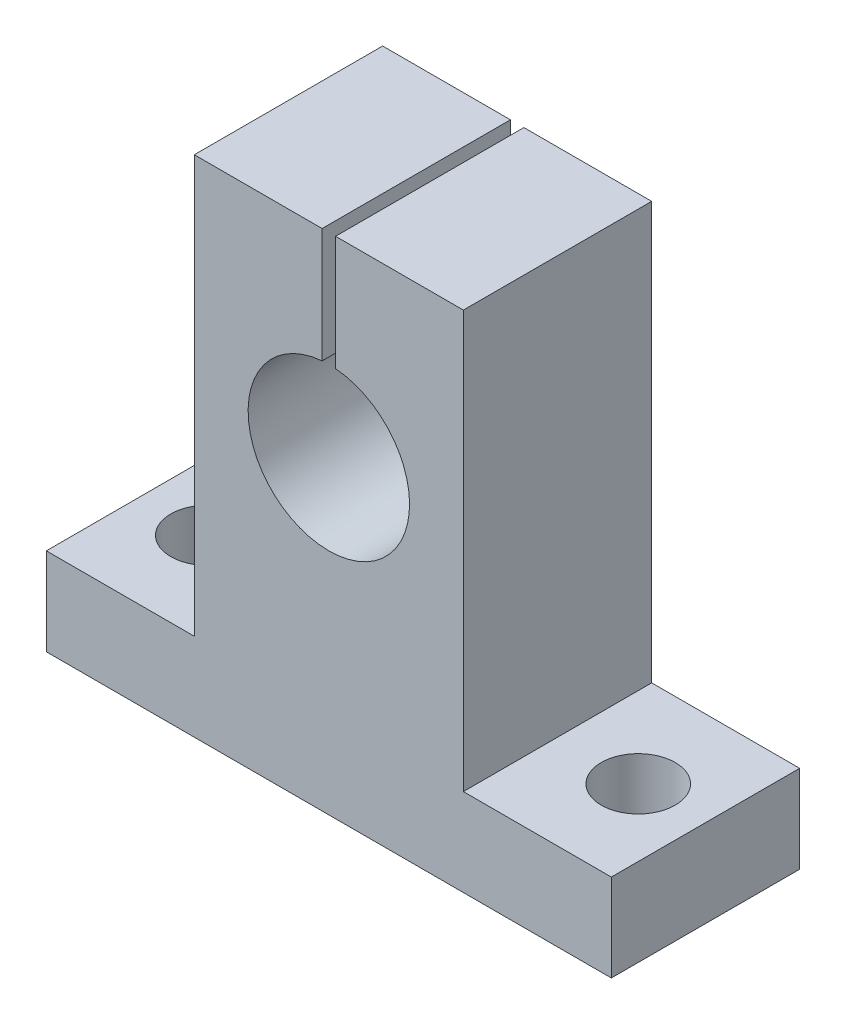
ISO-10303-21;
HEADER;
FILE_DESCRIPTION(('STEP AP214'),'2;1');
FILE_NAME('part.step','',(''),(''),'','','');
FILE_SCHEMA(('AUTOMOTIVE_DESIGN { 1 0 10303 214 1 1 1 1 }'));
ENDSEC;
DATA;
#1=APPLICATION_CONTEXT('core data for automotive mechanical design processes');
#2=APPLICATION_PROTOCOL_DEFINITION('international standard','automotive_design',2000,#1);
#3=PRODUCT_CONTEXT('',#1,'mechanical');
#4=PRODUCT('Part','Part','',(#3));
#5=PRODUCT_RELATED_PRODUCT_CATEGORY('part','',(#4));
#6=PRODUCT_DEFINITION_FORMATION('','',#4);
#7=PRODUCT_DEFINITION_CONTEXT('part definition',#1,'design');
#8=PRODUCT_DEFINITION('design','',#6,#7);
#9=PRODUCT_DEFINITION_SHAPE('','',#8);
#10=(LENGTH_UNIT() NAMED_UNIT(*) SI_UNIT(.MILLI.,.METRE.));
#11=(NAMED_UNIT(*) PLANE_ANGLE_UNIT() SI_UNIT($,.RADIAN.));
#12=(NAMED_UNIT(*) SI_UNIT($,.STERADIAN.) SOLID_ANGLE_UNIT());
#13=UNCERTAINTY_MEASURE_WITH_UNIT(LENGTH_MEASURE(1.E-05),#10,'distance_accuracy_value','');
#14=(GEOMETRIC_REPRESENTATION_CONTEXT(3) GLOBAL_UNCERTAINTY_ASSIGNED_CONTEXT((#13)) GLOBAL_UNIT_ASSIGNED_CONTEXT((#10,
#11,#12)) REPRESENTATION_CONTEXT('',''));
#15=CARTESIAN_POINT('',(0.,0.,0.));
#16=DIRECTION('',(0.,0.,1.));
#17=DIRECTION('',(1.,0.,0.));
#18=AXIS2_PLACEMENT_3D('',#15,#16,#17);
#19=CARTESIAN_POINT('',(-21.,-16.5,14.));
#20=DIRECTION('',(0.,1.,0.));
#21=DIRECTION('',(0.,0.,1.));
#22=AXIS2_PLACEMENT_3D('',#19,#20,#21);
#23=PLANE('',#22);
#24=CARTESIAN_POINT('',(-16.,-16.5,7.));
#25=DIRECTION('',(0.,1.,0.));
#26=DIRECTION('',(0.,0.,1.));
#27=AXIS2_PLACEMENT_3D('',#24,#25,#26);
#28=CIRCLE('',#27,2.75);
#29=CARTESIAN_POINT('',(-16.,-16.5,9.75));
#30=VERTEX_POINT('',#29);
#31=EDGE_CURVE('E271',#30,#30,#28,.F.);
#32=ORIENTED_EDGE('',*,*,#31,.T.);
#33=EDGE_LOOP('',(#32));
#34=FACE_BOUND('',#33,.T.);
#35=DIRECTION('',(1.,0.,0.));
#36=VECTOR('',#35,1.);
#37=CARTESIAN_POINT('',(-21.,-16.5,0.));
#38=LINE('',#37,#36);
#39=CARTESIAN_POINT('',(-21.,-16.5,0.));
#40=VERTEX_POINT('',#39);
#41=CARTESIAN_POINT('',(-9.99999999999999,-16.5,0.));
#42=VERTEX_POINT('',#41);
#43=EDGE_CURVE('E154',#40,#42,#38,.T.);
#44=ORIENTED_EDGE('',*,*,#43,.F.);
#45=DIRECTION('',(0.,0.,-1.));
#46=VECTOR('',#45,1.);
#47=CARTESIAN_POINT('',(-21.,-16.5,14.));
#48=LINE('',#47,#46);
#49=CARTESIAN_POINT('',(-21.,-16.5,14.));
#50=VERTEX_POINT('',#49);
#51=EDGE_CURVE('E11',#50,#40,#48,.T.);
#52=ORIENTED_EDGE('',*,*,#51,.F.);
#53=DIRECTION('',(1.,0.,0.));
#54=VECTOR('',#53,1.);
#55=CARTESIAN_POINT('',(-21.,-16.5,14.));
#56=LINE('',#55,#54);
#57=CARTESIAN_POINT('',(-9.99999999999999,-16.5,14.));
#58=VERTEX_POINT('',#57);
#59=EDGE_CURVE('E183',#50,#58,#56,.T.);
#60=ORIENTED_EDGE('',*,*,#59,.T.);
#61=DIRECTION('',(0.,0.,-1.));
#62=VECTOR('',#61,1.);
#63=CARTESIAN_POINT('',(-9.99999999999999,-16.5,14.));
#64=LINE('',#63,#62);
#65=EDGE_CURVE('E103',#58,#42,#64,.T.);
#66=ORIENTED_EDGE('',*,*,#65,.T.);
#67=EDGE_LOOP('',(#44,#52,#60,#66));
#68=FACE_BOUND('',#67,.T.);
#69=ADVANCED_FACE('F35',(#34,#68),#23,.T.);
#70=CARTESIAN_POINT('',(-21.,-23.,14.));
#71=DIRECTION('',(-1.,0.,0.));
#72=DIRECTION('',(0.,0.,1.));
#73=AXIS2_PLACEMENT_3D('',#70,#71,#72);
#74=PLANE('',#73);
#75=DIRECTION('',(0.,1.,0.));
#76=VECTOR('',#75,1.);
#77=CARTESIAN_POINT('',(-21.,-23.,0.));
#78=LINE('',#77,#76);
#79=CARTESIAN_POINT('',(-21.,-23.,0.));
#80=VERTEX_POINT('',#79);
#81=EDGE_CURVE('E181',#80,#40,#78,.T.);
#82=ORIENTED_EDGE('',*,*,#81,.F.);
#83=DIRECTION('',(0.,0.,-1.));
#84=VECTOR('',#83,1.);
#85=CARTESIAN_POINT('',(-21.,-23.,14.));
#86=LINE('',#85,#84);
#87=CARTESIAN_POINT('',(-21.,-23.,14.));
#88=VERTEX_POINT('',#87);
#89=EDGE_CURVE('E44',#88,#80,#86,.T.);
#90=ORIENTED_EDGE('',*,*,#89,.F.);
#91=DIRECTION('',(0.,1.,0.));
#92=VECTOR('',#91,1.);
#93=CARTESIAN_POINT('',(-21.,-23.,14.));
#94=LINE('',#93,#92);
#95=EDGE_CURVE('E149',#88,#50,#94,.T.);
#96=ORIENTED_EDGE('',*,*,#95,.T.);
#97=ORIENTED_EDGE('',*,*,#51,.T.);
#98=EDGE_LOOP('',(#82,#90,#96,#97));
#99=FACE_BOUND('',#98,.T.);
#100=ADVANCED_FACE('F207',(#99),#74,.T.);
#101=CARTESIAN_POINT('',(21.,-23.,14.));
#102=DIRECTION('',(0.,-1.,0.));
#103=DIRECTION('',(0.,0.,-1.));
#104=AXIS2_PLACEMENT_3D('',#101,#102,#103);
#105=PLANE('',#104);
#106=CARTESIAN_POINT('',(-16.,-23.,7.));
#107=DIRECTION('',(0.,-1.,0.));
#108=DIRECTION('',(0.,0.,-1.));
#109=AXIS2_PLACEMENT_3D('',#106,#107,#108);
#110=CIRCLE('',#109,2.75);
#111=CARTESIAN_POINT('',(-16.,-23.,4.25));
#112=VERTEX_POINT('',#111);
#113=EDGE_CURVE('E38',#112,#112,#110,.F.);
#114=ORIENTED_EDGE('',*,*,#113,.T.);
#115=EDGE_LOOP('',(#114));
#116=FACE_BOUND('',#115,.T.);
#117=CARTESIAN_POINT('',(16.,-23.,7.));
#118=DIRECTION('',(0.,-1.,0.));
#119=DIRECTION('',(0.,0.,-1.));
#120=AXIS2_PLACEMENT_3D('',#117,#118,#119);
#121=CIRCLE('',#120,2.75);
#122=CARTESIAN_POINT('',(16.,-23.,4.25));
#123=VERTEX_POINT('',#122);
#124=EDGE_CURVE('E272',#123,#123,#121,.F.);
#125=ORIENTED_EDGE('',*,*,#124,.T.);
#126=EDGE_LOOP('',(#125));
#127=FACE_BOUND('',#126,.T.);
#128=DIRECTION('',(-1.,0.,0.));
#129=VECTOR('',#128,1.);
#130=CARTESIAN_POINT('',(21.,-23.,0.));
#131=LINE('',#130,#129);
#132=CARTESIAN_POINT('',(21.,-23.,0.));
#133=VERTEX_POINT('',#132);
#134=EDGE_CURVE('E135',#133,#80,#131,.T.);
#135=ORIENTED_EDGE('',*,*,#134,.F.);
#136=DIRECTION('',(0.,0.,-1.));
#137=VECTOR('',#136,1.);
#138=CARTESIAN_POINT('',(21.,-23.,14.));
#139=LINE('',#138,#137);
#140=CARTESIAN_POINT('',(21.,-23.,14.));
#141=VERTEX_POINT('',#140);
#142=EDGE_CURVE('E129',#141,#133,#139,.T.);
#143=ORIENTED_EDGE('',*,*,#142,.F.);
#144=DIRECTION('',(-1.,0.,0.));
#145=VECTOR('',#144,1.);
#146=CARTESIAN_POINT('',(21.,-23.,14.));
#147=LINE('',#146,#145);
#148=EDGE_CURVE('E133',#141,#88,#147,.T.);
#149=ORIENTED_EDGE('',*,*,#148,.T.);
#150=ORIENTED_EDGE('',*,*,#89,.T.);
#151=EDGE_LOOP('',(#135,#143,#149,#150));
#152=FACE_BOUND('',#151,.T.);
#153=ADVANCED_FACE('F131',(#116,#127,#152),#105,.T.);
#154=CARTESIAN_POINT('',(21.,-23.,14.));
#155=DIRECTION('',(-1.,0.,0.));
#156=DIRECTION('',(0.,0.,1.));
#157=AXIS2_PLACEMENT_3D('',#154,#155,#156);
#158=PLANE('',#157);
#159=DIRECTION('',(0.,1.,0.));
#160=VECTOR('',#159,1.);
#161=CARTESIAN_POINT('',(21.,-23.,0.));
#162=LINE('',#161,#160);
#163=CARTESIAN_POINT('',(21.,-16.5,0.));
#164=VERTEX_POINT('',#163);
#165=EDGE_CURVE('E178',#133,#164,#162,.T.);
#166=ORIENTED_EDGE('',*,*,#165,.T.);
#167=DIRECTION('',(0.,0.,-1.));
#168=VECTOR('',#167,1.);
#169=CARTESIAN_POINT('',(21.,-16.5,14.));
#170=LINE('',#169,#168);
#171=CARTESIAN_POINT('',(21.,-16.5,14.));
#172=VERTEX_POINT('',#171);
#173=EDGE_CURVE('E138',#172,#164,#170,.T.);
#174=ORIENTED_EDGE('',*,*,#173,.F.);
#175=DIRECTION('',(0.,1.,0.));
#176=VECTOR('',#175,1.);
#177=CARTESIAN_POINT('',(21.,-23.,14.));
#178=LINE('',#177,#176);
#179=EDGE_CURVE('E141',#141,#172,#178,.T.);
#180=ORIENTED_EDGE('',*,*,#179,.F.);
#181=ORIENTED_EDGE('',*,*,#142,.T.);
#182=EDGE_LOOP('',(#166,#174,#180,#181));
#183=FACE_BOUND('',#182,.T.);
#184=ADVANCED_FACE('F142',(#183),#158,.F.);
#185=CARTESIAN_POINT('',(21.,-16.5,14.));
#186=DIRECTION('',(0.,-1.,0.));
#187=DIRECTION('',(0.,0.,-1.));
#188=AXIS2_PLACEMENT_3D('',#185,#186,#187);
#189=PLANE('',#188);
#190=CARTESIAN_POINT('',(16.,-16.5,7.));
#191=DIRECTION('',(0.,-1.,0.));
#192=DIRECTION('',(0.,0.,-1.));
#193=AXIS2_PLACEMENT_3D('',#190,#191,#192);
#194=CIRCLE('',#193,2.75);
#195=CARTESIAN_POINT('',(16.,-16.5,4.25));
#196=VERTEX_POINT('',#195);
#197=EDGE_CURVE('E273',#196,#196,#194,.F.);
#198=ORIENTED_EDGE('',*,*,#197,.F.);
#199=EDGE_LOOP('',(#198));
#200=FACE_BOUND('',#199,.T.);
#201=DIRECTION('',(-1.,0.,0.));
#202=VECTOR('',#201,1.);
#203=CARTESIAN_POINT('',(21.,-16.5,0.));
#204=LINE('',#203,#202);
#205=CARTESIAN_POINT('',(10.,-16.5,0.));
#206=VERTEX_POINT('',#205);
#207=EDGE_CURVE('E176',#164,#206,#204,.T.);
#208=ORIENTED_EDGE('',*,*,#207,.T.);
#209=DIRECTION('',(0.,0.,-1.));
#210=VECTOR('',#209,1.);
#211=CARTESIAN_POINT('',(10.,-16.5,14.));
#212=LINE('',#211,#210);
#213=CARTESIAN_POINT('',(10.,-16.5,14.));
#214=VERTEX_POINT('',#213);
#215=EDGE_CURVE('E187',#214,#206,#212,.T.);
#216=ORIENTED_EDGE('',*,*,#215,.F.);
#217=DIRECTION('',(-1.,0.,0.));
#218=VECTOR('',#217,1.);
#219=CARTESIAN_POINT('',(21.,-16.5,14.));
#220=LINE('',#219,#218);
#221=EDGE_CURVE('E146',#172,#214,#220,.T.);
#222=ORIENTED_EDGE('',*,*,#221,.F.);
#223=ORIENTED_EDGE('',*,*,#173,.T.);
#224=EDGE_LOOP('',(#208,#216,#222,#223));
#225=FACE_BOUND('',#224,.T.);
#226=ADVANCED_FACE('F222',(#200,#225),#189,.F.);
#227=CARTESIAN_POINT('',(10.,-16.5,14.));
#228=DIRECTION('',(-1.,0.,0.));
#229=DIRECTION('',(0.,-1.,0.));
#230=AXIS2_PLACEMENT_3D('',#227,#228,#229);
#231=PLANE('',#230);
#232=DIRECTION('',(0.,1.,0.));
#233=VECTOR('',#232,1.);
#234=CARTESIAN_POINT('',(10.,-16.5,0.));
#235=LINE('',#234,#233);
#236=CARTESIAN_POINT('',(10.,14.5,0.));
#237=VERTEX_POINT('',#236);
#238=EDGE_CURVE('E174',#206,#237,#235,.T.);
#239=ORIENTED_EDGE('',*,*,#238,.T.);
#240=DIRECTION('',(0.,0.,-1.));
#241=VECTOR('',#240,1.);
#242=CARTESIAN_POINT('',(10.,14.5,14.));
#243=LINE('',#242,#241);
#244=CARTESIAN_POINT('',(10.,14.5,14.));
#245=VERTEX_POINT('',#244);
#246=EDGE_CURVE('E190',#245,#237,#243,.T.);
#247=ORIENTED_EDGE('',*,*,#246,.F.);
#248=DIRECTION('',(0.,1.,0.));
#249=VECTOR('',#248,1.);
#250=CARTESIAN_POINT('',(10.,-16.5,14.));
#251=LINE('',#250,#249);
#252=EDGE_CURVE('E296',#214,#245,#251,.T.);
#253=ORIENTED_EDGE('',*,*,#252,.F.);
#254=ORIENTED_EDGE('',*,*,#215,.T.);
#255=EDGE_LOOP('',(#239,#247,#253,#254));
#256=FACE_BOUND('',#255,.T.);
#257=ADVANCED_FACE('F225',(#256),#231,.F.);
#258=CARTESIAN_POINT('',(10.,14.5,14.));
#259=DIRECTION('',(0.,-1.,0.));
#260=DIRECTION('',(1.,0.,0.));
#261=AXIS2_PLACEMENT_3D('',#258,#259,#260);
#262=PLANE('',#261);
#263=DIRECTION('',(-1.,0.,0.));
#264=VECTOR('',#263,1.);
#265=CARTESIAN_POINT('',(10.,14.5,0.));
#266=LINE('',#265,#264);
#267=CARTESIAN_POINT('',(0.500000000000011,14.5,0.));
#268=VERTEX_POINT('',#267);
#269=EDGE_CURVE('E172',#237,#268,#266,.T.);
#270=ORIENTED_EDGE('',*,*,#269,.T.);
#271=DIRECTION('',(0.,0.,-1.));
#272=VECTOR('',#271,1.);
#273=CARTESIAN_POINT('',(0.500000000000011,14.5,14.));
#274=LINE('',#273,#272);
#275=CARTESIAN_POINT('',(0.500000000000011,14.5,14.));
#276=VERTEX_POINT('',#275);
#277=EDGE_CURVE('E193',#276,#268,#274,.T.);
#278=ORIENTED_EDGE('',*,*,#277,.F.);
#279=DIRECTION('',(-1.,0.,0.));
#280=VECTOR('',#279,1.);
#281=CARTESIAN_POINT('',(10.,14.5,14.));
#282=LINE('',#281,#280);
#283=EDGE_CURVE('E294',#245,#276,#282,.T.);
#284=ORIENTED_EDGE('',*,*,#283,.F.);
#285=ORIENTED_EDGE('',*,*,#246,.T.);
#286=EDGE_LOOP('',(#270,#278,#284,#285));
#287=FACE_BOUND('',#286,.T.);
#288=ADVANCED_FACE('F229',(#287),#262,.F.);
#289=CARTESIAN_POINT('',(0.500000000000011,14.5,14.));
#290=DIRECTION('',(1.,0.,0.));
#291=DIRECTION('',(0.,1.,0.));
#292=AXIS2_PLACEMENT_3D('',#289,#290,#291);
#293=PLANE('',#292);
#294=DIRECTION('',(0.,-1.,0.));
#295=VECTOR('',#294,1.);
#296=CARTESIAN_POINT('',(0.500000000000011,14.5,0.));
#297=LINE('',#296,#295);
#298=CARTESIAN_POINT('',(0.500000000000009,5.9791303715507,0.));
#299=VERTEX_POINT('',#298);
#300=EDGE_CURVE('E169',#268,#299,#297,.T.);
#301=ORIENTED_EDGE('',*,*,#300,.T.);
#302=DIRECTION('',(0.,0.,-1.));
#303=VECTOR('',#302,1.);
#304=CARTESIAN_POINT('',(0.500000000000009,5.9791303715507,14.));
#305=LINE('',#304,#303);
#306=CARTESIAN_POINT('',(0.500000000000009,5.9791303715507,14.));
#307=VERTEX_POINT('',#306);
#308=EDGE_CURVE('E196',#307,#299,#305,.T.);
#309=ORIENTED_EDGE('',*,*,#308,.F.);
#310=DIRECTION('',(0.,-1.,0.));
#311=VECTOR('',#310,1.);
#312=CARTESIAN_POINT('',(0.500000000000011,14.5,14.));
#313=LINE('',#312,#311);
#314=EDGE_CURVE('E292',#276,#307,#313,.T.);
#315=ORIENTED_EDGE('',*,*,#314,.F.);
#316=ORIENTED_EDGE('',*,*,#277,.T.);
#317=EDGE_LOOP('',(#301,#309,#315,#316));
#318=FACE_BOUND('',#317,.T.);
#319=ADVANCED_FACE('F233',(#318),#293,.F.);
#320=CARTESIAN_POINT('',(0.,0.,14.));
#321=DIRECTION('',(0.,0.,-1.));
#322=DIRECTION('',(-1.,0.,0.));
#323=AXIS2_PLACEMENT_3D('',#320,#321,#322);
#324=CYLINDRICAL_SURFACE('',#323,6.);
#325=CARTESIAN_POINT('',(0.,0.,0.));
#326=DIRECTION('',(0.,0.,1.));
#327=DIRECTION('',(1.,0.,0.));
#328=AXIS2_PLACEMENT_3D('',#325,#326,#327);
#329=CIRCLE('',#328,6.);
#330=CARTESIAN_POINT('',(-0.49999999999999,5.9791303715507,0.));
#331=VERTEX_POINT('',#330);
#332=EDGE_CURVE('E166',#331,#299,#329,.T.);
#333=ORIENTED_EDGE('',*,*,#332,.F.);
#334=DIRECTION('',(0.,0.,-1.));
#335=VECTOR('',#334,1.);
#336=CARTESIAN_POINT('',(-0.49999999999999,5.9791303715507,14.));
#337=LINE('',#336,#335);
#338=CARTESIAN_POINT('',(-0.49999999999999,5.9791303715507,14.));
#339=VERTEX_POINT('',#338);
#340=EDGE_CURVE('E198',#339,#331,#337,.T.);
#341=ORIENTED_EDGE('',*,*,#340,.F.);
#342=CARTESIAN_POINT('',(0.,0.,14.));
#343=DIRECTION('',(0.,0.,1.));
#344=DIRECTION('',(1.,0.,0.));
#345=AXIS2_PLACEMENT_3D('',#342,#343,#344);
#346=CIRCLE('',#345,6.);
#347=EDGE_CURVE('E289',#339,#307,#346,.T.);
#348=ORIENTED_EDGE('',*,*,#347,.T.);
#349=ORIENTED_EDGE('',*,*,#308,.T.);
#350=EDGE_LOOP('',(#333,#341,#348,#349));
#351=FACE_BOUND('',#350,.T.);
#352=ADVANCED_FACE('F237',(#351),#324,.F.);
#353=CARTESIAN_POINT('',(-0.49999999999999,14.5,14.));
#354=DIRECTION('',(1.,0.,0.));
#355=DIRECTION('',(0.,0.,-1.));
#356=AXIS2_PLACEMENT_3D('',#353,#354,#355);
#357=PLANE('',#356);
#358=DIRECTION('',(0.,-1.,0.));
#359=VECTOR('',#358,1.);
#360=CARTESIAN_POINT('',(-0.49999999999999,14.5,0.));
#361=LINE('',#360,#359);
#362=CARTESIAN_POINT('',(-0.49999999999999,14.5,0.));
#363=VERTEX_POINT('',#362);
#364=EDGE_CURVE('E163',#363,#331,#361,.T.);
#365=ORIENTED_EDGE('',*,*,#364,.F.);
#366=DIRECTION('',(0.,0.,-1.));
#367=VECTOR('',#366,1.);
#368=CARTESIAN_POINT('',(-0.49999999999999,14.5,14.));
#369=LINE('',#368,#367);
#370=CARTESIAN_POINT('',(-0.49999999999999,14.5,14.));
#371=VERTEX_POINT('',#370);
#372=EDGE_CURVE('E200',#371,#363,#369,.T.);
#373=ORIENTED_EDGE('',*,*,#372,.F.);
#374=DIRECTION('',(0.,-1.,0.));
#375=VECTOR('',#374,1.);
#376=CARTESIAN_POINT('',(-0.49999999999999,14.5,14.));
#377=LINE('',#376,#375);
#378=EDGE_CURVE('E286',#371,#339,#377,.T.);
#379=ORIENTED_EDGE('',*,*,#378,.T.);
#380=ORIENTED_EDGE('',*,*,#340,.T.);
#381=EDGE_LOOP('',(#365,#373,#379,#380));
#382=FACE_BOUND('',#381,.T.);
#383=ADVANCED_FACE('F241',(#382),#357,.T.);
#384=CARTESIAN_POINT('',(-9.99999999999999,14.5,14.));
#385=DIRECTION('',(0.,1.,0.));
#386=DIRECTION('',(-1.,0.,0.));
#387=AXIS2_PLACEMENT_3D('',#384,#385,#386);
#388=PLANE('',#387);
#389=DIRECTION('',(1.,0.,0.));
#390=VECTOR('',#389,1.);
#391=CARTESIAN_POINT('',(-9.99999999999999,14.5,0.));
#392=LINE('',#391,#390);
#393=CARTESIAN_POINT('',(-9.99999999999999,14.5,0.));
#394=VERTEX_POINT('',#393);
#395=EDGE_CURVE('E160',#394,#363,#392,.T.);
#396=ORIENTED_EDGE('',*,*,#395,.F.);
#397=DIRECTION('',(0.,0.,-1.));
#398=VECTOR('',#397,1.);
#399=CARTESIAN_POINT('',(-9.99999999999999,14.5,14.));
#400=LINE('',#399,#398);
#401=CARTESIAN_POINT('',(-9.99999999999999,14.5,14.));
#402=VERTEX_POINT('',#401);
#403=EDGE_CURVE('E202',#402,#394,#400,.T.);
#404=ORIENTED_EDGE('',*,*,#403,.F.);
#405=DIRECTION('',(1.,0.,0.));
#406=VECTOR('',#405,1.);
#407=CARTESIAN_POINT('',(-9.99999999999999,14.5,14.));
#408=LINE('',#407,#406);
#409=EDGE_CURVE('E283',#402,#371,#408,.T.);
#410=ORIENTED_EDGE('',*,*,#409,.T.);
#411=ORIENTED_EDGE('',*,*,#372,.T.);
#412=EDGE_LOOP('',(#396,#404,#410,#411));
#413=FACE_BOUND('',#412,.T.);
#414=ADVANCED_FACE('F245',(#413),#388,.T.);
#415=CARTESIAN_POINT('',(-9.99999999999999,-16.5,14.));
#416=DIRECTION('',(-1.,0.,0.));
#417=DIRECTION('',(0.,0.,1.));
#418=AXIS2_PLACEMENT_3D('',#415,#416,#417);
#419=PLANE('',#418);
#420=DIRECTION('',(0.,1.,0.));
#421=VECTOR('',#420,1.);
#422=CARTESIAN_POINT('',(-9.99999999999999,-16.5,0.));
#423=LINE('',#422,#421);
#424=EDGE_CURVE('E157',#42,#394,#423,.T.);
#425=ORIENTED_EDGE('',*,*,#424,.F.);
#426=ORIENTED_EDGE('',*,*,#65,.F.);
#427=DIRECTION('',(0.,1.,0.));
#428=VECTOR('',#427,1.);
#429=CARTESIAN_POINT('',(-9.99999999999999,-16.5,14.));
#430=LINE('',#429,#428);
#431=EDGE_CURVE('E281',#58,#402,#430,.T.);
#432=ORIENTED_EDGE('',*,*,#431,.T.);
#433=ORIENTED_EDGE('',*,*,#403,.T.);
#434=EDGE_LOOP('',(#425,#426,#432,#433));
#435=FACE_BOUND('',#434,.T.);
#436=ADVANCED_FACE('F203',(#435),#419,.T.);
#437=CARTESIAN_POINT('',(0.,0.,14.));
#438=DIRECTION('',(0.,0.,1.));
#439=DIRECTION('',(1.,0.,0.));
#440=AXIS2_PLACEMENT_3D('',#437,#438,#439);
#441=PLANE('',#440);
#442=ORIENTED_EDGE('',*,*,#59,.F.);
#443=ORIENTED_EDGE('',*,*,#95,.F.);
#444=ORIENTED_EDGE('',*,*,#148,.F.);
#445=ORIENTED_EDGE('',*,*,#179,.T.);
#446=ORIENTED_EDGE('',*,*,#221,.T.);
#447=ORIENTED_EDGE('',*,*,#252,.T.);
#448=ORIENTED_EDGE('',*,*,#283,.T.);
#449=ORIENTED_EDGE('',*,*,#314,.T.);
#450=ORIENTED_EDGE('',*,*,#347,.F.);
#451=ORIENTED_EDGE('',*,*,#378,.F.);
#452=ORIENTED_EDGE('',*,*,#409,.F.);
#453=ORIENTED_EDGE('',*,*,#431,.F.);
#454=EDGE_LOOP('',(#442,#443,#444,#445,#446,#447,#448,#449,#450,#451,#452,#453));
#455=FACE_BOUND('',#454,.T.);
#456=ADVANCED_FACE('F148',(#455),#441,.T.);
#457=CARTESIAN_POINT('',(0.,0.,0.));
#458=DIRECTION('',(0.,0.,1.));
#459=DIRECTION('',(1.,0.,0.));
#460=AXIS2_PLACEMENT_3D('',#457,#458,#459);
#461=PLANE('',#460);
#462=ORIENTED_EDGE('',*,*,#43,.T.);
#463=ORIENTED_EDGE('',*,*,#424,.T.);
#464=ORIENTED_EDGE('',*,*,#395,.T.);
#465=ORIENTED_EDGE('',*,*,#364,.T.);
#466=ORIENTED_EDGE('',*,*,#332,.T.);
#467=ORIENTED_EDGE('',*,*,#300,.F.);
#468=ORIENTED_EDGE('',*,*,#269,.F.);
#469=ORIENTED_EDGE('',*,*,#238,.F.);
#470=ORIENTED_EDGE('',*,*,#207,.F.);
#471=ORIENTED_EDGE('',*,*,#165,.F.);
#472=ORIENTED_EDGE('',*,*,#134,.T.);
#473=ORIENTED_EDGE('',*,*,#81,.T.);
#474=EDGE_LOOP('',(#462,#463,#464,#465,#466,#467,#468,#469,#470,#471,#472,#473));
#475=FACE_BOUND('',#474,.T.);
#476=ADVANCED_FACE('F206',(#475),#461,.F.);
#477=CARTESIAN_POINT('',(16.,-23.000012,7.));
#478=DIRECTION('',(0.,1.,0.));
#479=DIRECTION('',(0.,0.,1.));
#480=AXIS2_PLACEMENT_3D('',#477,#478,#479);
#481=CYLINDRICAL_SURFACE('',#480,2.75);
#482=ORIENTED_EDGE('',*,*,#124,.F.);
#483=EDGE_LOOP('',(#482));
#484=FACE_BOUND('',#483,.T.);
#485=ORIENTED_EDGE('',*,*,#197,.T.);
#486=EDGE_LOOP('',(#485));
#487=FACE_BOUND('',#486,.T.);
#488=ADVANCED_FACE('F256',(#484,#487),#481,.F.);
#489=CARTESIAN_POINT('',(-16.,-23.000012,7.));
#490=DIRECTION('',(0.,1.,0.));
#491=DIRECTION('',(0.,0.,1.));
#492=AXIS2_PLACEMENT_3D('',#489,#490,#491);
#493=CYLINDRICAL_SURFACE('',#492,2.75);
#494=ORIENTED_EDGE('',*,*,#113,.F.);
#495=EDGE_LOOP('',(#494));
#496=FACE_BOUND('',#495,.T.);
#497=ORIENTED_EDGE('',*,*,#31,.F.);
#498=EDGE_LOOP('',(#497));
#499=FACE_BOUND('',#498,.T.);
#500=ADVANCED_FACE('F260',(#496,#499),#493,.F.);
#501=CLOSED_SHELL('',(#69,#100,#153,#184,#226,#257,#288,#319,#352,#383,#414,#436,#456,#476,#488,#500));
#502=MANIFOLD_SOLID_BREP('B2',#501);
#503=ADVANCED_BREP_SHAPE_REPRESENTATION('',(#18,#502),#14);
#504=SHAPE_DEFINITION_REPRESENTATION(#9,#503);
ENDSEC;
END-ISO-10303-21;
